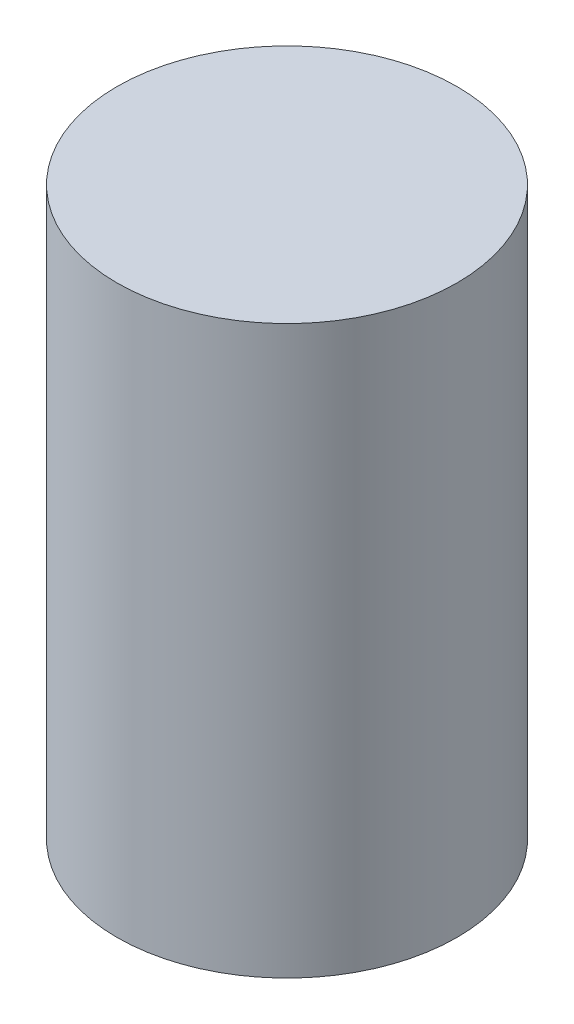
ISO-10303-21;
HEADER;
FILE_DESCRIPTION(('STEP AP214'),'2;1');
FILE_NAME('part.step','',(''),(''),'','','');
FILE_SCHEMA(('AUTOMOTIVE_DESIGN { 1 0 10303 214 1 1 1 1 }'));
ENDSEC;
DATA;
#1=APPLICATION_CONTEXT('core data for automotive mechanical design processes');
#2=APPLICATION_PROTOCOL_DEFINITION('international standard','automotive_design',2000,#1);
#3=PRODUCT_CONTEXT('',#1,'mechanical');
#4=PRODUCT('Part','Part','',(#3));
#5=PRODUCT_RELATED_PRODUCT_CATEGORY('part','',(#4));
#6=PRODUCT_DEFINITION_FORMATION('','',#4);
#7=PRODUCT_DEFINITION_CONTEXT('part definition',#1,'design');
#8=PRODUCT_DEFINITION('design','',#6,#7);
#9=PRODUCT_DEFINITION_SHAPE('','',#8);
#10=(LENGTH_UNIT() NAMED_UNIT(*) SI_UNIT(.MILLI.,.METRE.));
#11=(NAMED_UNIT(*) PLANE_ANGLE_UNIT() SI_UNIT($,.RADIAN.));
#12=(NAMED_UNIT(*) SI_UNIT($,.STERADIAN.) SOLID_ANGLE_UNIT());
#13=UNCERTAINTY_MEASURE_WITH_UNIT(LENGTH_MEASURE(1.E-05),#10,'distance_accuracy_value','');
#14=(GEOMETRIC_REPRESENTATION_CONTEXT(3) GLOBAL_UNCERTAINTY_ASSIGNED_CONTEXT((#13)) GLOBAL_UNIT_ASSIGNED_CONTEXT((#10,
#11,#12)) REPRESENTATION_CONTEXT('',''));
#15=CARTESIAN_POINT('',(0.,0.,0.));
#16=DIRECTION('',(0.,0.,1.));
#17=DIRECTION('',(1.,0.,0.));
#18=AXIS2_PLACEMENT_3D('',#15,#16,#17);
#19=CARTESIAN_POINT('',(0.,12.7,0.));
#20=DIRECTION('',(0.,-1.,0.));
#21=DIRECTION('',(0.,0.,-1.));
#22=AXIS2_PLACEMENT_3D('',#19,#20,#21);
#23=CYLINDRICAL_SURFACE('',#22,3.81);
#24=CARTESIAN_POINT('',(0.,12.7,0.));
#25=DIRECTION('',(0.,1.,0.));
#26=DIRECTION('',(0.,0.,1.));
#27=AXIS2_PLACEMENT_3D('',#24,#25,#26);
#28=CIRCLE('',#27,3.81);
#29=CARTESIAN_POINT('',(0.,12.7,3.81));
#30=VERTEX_POINT('',#29);
#31=EDGE_CURVE('E10',#30,#30,#28,.T.);
#32=ORIENTED_EDGE('',*,*,#31,.F.);
#33=EDGE_LOOP('',(#32));
#34=FACE_BOUND('',#33,.T.);
#35=CARTESIAN_POINT('',(0.,0.,0.));
#36=DIRECTION('',(0.,1.,0.));
#37=DIRECTION('',(0.,0.,1.));
#38=AXIS2_PLACEMENT_3D('',#35,#36,#37);
#39=CIRCLE('',#38,3.81);
#40=CARTESIAN_POINT('',(0.,0.,3.81));
#41=VERTEX_POINT('',#40);
#42=EDGE_CURVE('E34',#41,#41,#39,.T.);
#43=ORIENTED_EDGE('',*,*,#42,.T.);
#44=EDGE_LOOP('',(#43));
#45=FACE_BOUND('',#44,.T.);
#46=ADVANCED_FACE('F31',(#34,#45),#23,.T.);
#47=CARTESIAN_POINT('',(0.,12.7,0.));
#48=DIRECTION('',(0.,1.,0.));
#49=DIRECTION('',(0.,0.,1.));
#50=AXIS2_PLACEMENT_3D('',#47,#48,#49);
#51=PLANE('',#50);
#52=ORIENTED_EDGE('',*,*,#31,.T.);
#53=EDGE_LOOP('',(#52));
#54=FACE_BOUND('',#53,.T.);
#55=ADVANCED_FACE('F46',(#54),#51,.T.);
#56=CARTESIAN_POINT('',(0.,0.,0.));
#57=DIRECTION('',(0.,1.,0.));
#58=DIRECTION('',(0.,0.,1.));
#59=AXIS2_PLACEMENT_3D('',#56,#57,#58);
#60=PLANE('',#59);
#61=ORIENTED_EDGE('',*,*,#42,.F.);
#62=EDGE_LOOP('',(#61));
#63=FACE_BOUND('',#62,.T.);
#64=ADVANCED_FACE('F44',(#63),#60,.F.);
#65=CLOSED_SHELL('',(#46,#55,#64));
#66=MANIFOLD_SOLID_BREP('B2',#65);
#67=ADVANCED_BREP_SHAPE_REPRESENTATION('',(#18,#66),#14);
#68=SHAPE_DEFINITION_REPRESENTATION(#9,#67);
ENDSEC;
END-ISO-10303-21;
